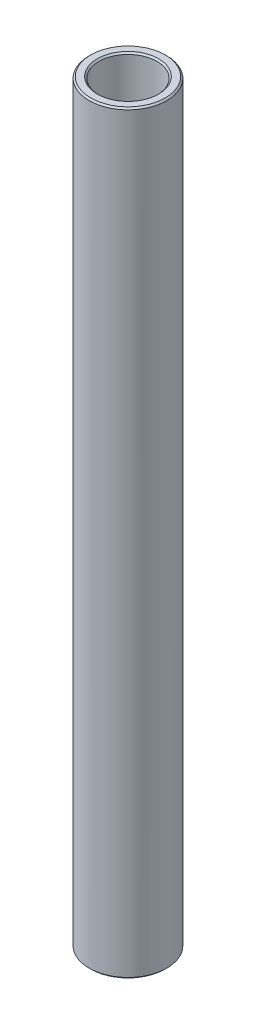
ISO-10303-21;
HEADER;
FILE_DESCRIPTION(('STEP AP214'),'2;1');
FILE_NAME('part.step','',(''),(''),'','','');
FILE_SCHEMA(('AUTOMOTIVE_DESIGN { 1 0 10303 214 1 1 1 1 }'));
ENDSEC;
DATA;
#1=APPLICATION_CONTEXT('core data for automotive mechanical design processes');
#2=APPLICATION_PROTOCOL_DEFINITION('international standard','automotive_design',2000,#1);
#3=PRODUCT_CONTEXT('',#1,'mechanical');
#4=PRODUCT('Part','Part','',(#3));
#5=PRODUCT_RELATED_PRODUCT_CATEGORY('part','',(#4));
#6=PRODUCT_DEFINITION_FORMATION('','',#4);
#7=PRODUCT_DEFINITION_CONTEXT('part definition',#1,'design');
#8=PRODUCT_DEFINITION('design','',#6,#7);
#9=PRODUCT_DEFINITION_SHAPE('','',#8);
#10=(LENGTH_UNIT() NAMED_UNIT(*) SI_UNIT(.MILLI.,.METRE.));
#11=(NAMED_UNIT(*) PLANE_ANGLE_UNIT() SI_UNIT($,.RADIAN.));
#12=(NAMED_UNIT(*) SI_UNIT($,.STERADIAN.) SOLID_ANGLE_UNIT());
#13=UNCERTAINTY_MEASURE_WITH_UNIT(LENGTH_MEASURE(1.E-05),#10,'distance_accuracy_value','');
#14=(GEOMETRIC_REPRESENTATION_CONTEXT(3) GLOBAL_UNCERTAINTY_ASSIGNED_CONTEXT((#13)) GLOBAL_UNIT_ASSIGNED_CONTEXT((#10,
#11,#12)) REPRESENTATION_CONTEXT('',''));
#15=CARTESIAN_POINT('',(0.,0.,0.));
#16=DIRECTION('',(0.,0.,1.));
#17=DIRECTION('',(1.,0.,0.));
#18=AXIS2_PLACEMENT_3D('',#15,#16,#17);
#19=CARTESIAN_POINT('',(0.,11.60859375,0.));
#20=DIRECTION('',(0.,1.,0.));
#21=DIRECTION('',(-1.,0.,0.));
#22=AXIS2_PLACEMENT_3D('',#19,#20,#21);
#23=CYLINDRICAL_SURFACE('',#22,4.7625);
#24=CARTESIAN_POINT('',(0.,-61.462285,0.));
#25=DIRECTION('',(0.,1.,0.));
#26=DIRECTION('',(-1.,0.,0.));
#27=AXIS2_PLACEMENT_3D('',#24,#25,#26);
#28=CIRCLE('',#27,4.7625);
#29=CARTESIAN_POINT('',(-4.76250000000001,-61.462285,0.));
#30=VERTEX_POINT('',#29);
#31=EDGE_CURVE('E52',#30,#30,#28,.F.);
#32=ORIENTED_EDGE('',*,*,#31,.T.);
#33=EDGE_LOOP('',(#32));
#34=FACE_BOUND('',#33,.T.);
#35=CARTESIAN_POINT('',(0.,61.462285,0.));
#36=DIRECTION('',(0.,-1.,0.));
#37=DIRECTION('',(1.,0.,0.));
#38=AXIS2_PLACEMENT_3D('',#35,#36,#37);
#39=CIRCLE('',#38,4.7625);
#40=CARTESIAN_POINT('',(4.76250000000001,61.462285,0.));
#41=VERTEX_POINT('',#40);
#42=EDGE_CURVE('E55',#41,#41,#39,.F.);
#43=ORIENTED_EDGE('',*,*,#42,.T.);
#44=EDGE_LOOP('',(#43));
#45=FACE_BOUND('',#44,.T.);
#46=ADVANCED_FACE('F32',(#34,#45),#23,.F.);
#47=CARTESIAN_POINT('',(4.76249999999999,61.716285,0.));
#48=DIRECTION('',(0.,-1.,0.));
#49=DIRECTION('',(1.,0.,0.));
#50=AXIS2_PLACEMENT_3D('',#47,#48,#49);
#51=PLANE('',#50);
#52=CARTESIAN_POINT('',(0.,61.716285,0.));
#53=DIRECTION('',(0.,-1.,0.));
#54=DIRECTION('',(1.,0.,0.));
#55=AXIS2_PLACEMENT_3D('',#52,#53,#54);
#56=CIRCLE('',#55,6.096);
#57=CARTESIAN_POINT('',(6.09600000000001,61.716285,0.));
#58=VERTEX_POINT('',#57);
#59=EDGE_CURVE('E10',#58,#58,#56,.F.);
#60=ORIENTED_EDGE('',*,*,#59,.T.);
#61=EDGE_LOOP('',(#60));
#62=FACE_BOUND('',#61,.T.);
#63=CARTESIAN_POINT('',(0.,61.716285,0.));
#64=DIRECTION('',(0.,-1.,0.));
#65=DIRECTION('',(1.,0.,0.));
#66=AXIS2_PLACEMENT_3D('',#63,#64,#65);
#67=CIRCLE('',#66,5.01650000000002);
#68=CARTESIAN_POINT('',(5.01650000000003,61.716285,0.));
#69=VERTEX_POINT('',#68);
#70=EDGE_CURVE('E39',#69,#69,#67,.T.);
#71=ORIENTED_EDGE('',*,*,#70,.T.);
#72=EDGE_LOOP('',(#71));
#73=FACE_BOUND('',#72,.T.);
#74=ADVANCED_FACE('F78',(#62,#73),#51,.F.);
#75=CARTESIAN_POINT('',(0.,11.60859375,0.));
#76=DIRECTION('',(0.,1.,0.));
#77=DIRECTION('',(-1.,0.,0.));
#78=AXIS2_PLACEMENT_3D('',#75,#76,#77);
#79=CYLINDRICAL_SURFACE('',#78,6.35);
#80=CARTESIAN_POINT('',(0.,-61.462285,0.));
#81=DIRECTION('',(0.,1.,0.));
#82=DIRECTION('',(-1.,0.,0.));
#83=AXIS2_PLACEMENT_3D('',#80,#81,#82);
#84=CIRCLE('',#83,6.35);
#85=CARTESIAN_POINT('',(-6.35000000000001,-61.462285,0.));
#86=VERTEX_POINT('',#85);
#87=EDGE_CURVE('E43',#86,#86,#84,.T.);
#88=ORIENTED_EDGE('',*,*,#87,.T.);
#89=EDGE_LOOP('',(#88));
#90=FACE_BOUND('',#89,.T.);
#91=CARTESIAN_POINT('',(0.,61.462285,0.));
#92=DIRECTION('',(0.,-1.,0.));
#93=DIRECTION('',(1.,0.,0.));
#94=AXIS2_PLACEMENT_3D('',#91,#92,#93);
#95=CIRCLE('',#94,6.35);
#96=CARTESIAN_POINT('',(6.35000000000001,61.462285,0.));
#97=VERTEX_POINT('',#96);
#98=EDGE_CURVE('E47',#97,#97,#95,.T.);
#99=ORIENTED_EDGE('',*,*,#98,.T.);
#100=EDGE_LOOP('',(#99));
#101=FACE_BOUND('',#100,.T.);
#102=ADVANCED_FACE('F75',(#90,#101),#79,.T.);
#103=CARTESIAN_POINT('',(6.35000000000001,-61.716285,0.));
#104=DIRECTION('',(0.,1.,0.));
#105=DIRECTION('',(-1.,0.,0.));
#106=AXIS2_PLACEMENT_3D('',#103,#104,#105);
#107=PLANE('',#106);
#108=CARTESIAN_POINT('',(0.,-61.716285,0.));
#109=DIRECTION('',(0.,1.,0.));
#110=DIRECTION('',(-1.,0.,0.));
#111=AXIS2_PLACEMENT_3D('',#108,#109,#110);
#112=CIRCLE('',#111,5.01649999999999);
#113=CARTESIAN_POINT('',(-5.0165,-61.716285,0.));
#114=VERTEX_POINT('',#113);
#115=EDGE_CURVE('E58',#114,#114,#112,.T.);
#116=ORIENTED_EDGE('',*,*,#115,.T.);
#117=EDGE_LOOP('',(#116));
#118=FACE_BOUND('',#117,.T.);
#119=CARTESIAN_POINT('',(0.,-61.716285,0.));
#120=DIRECTION('',(0.,1.,0.));
#121=DIRECTION('',(-1.,0.,0.));
#122=AXIS2_PLACEMENT_3D('',#119,#120,#121);
#123=CIRCLE('',#122,6.09599999999998);
#124=CARTESIAN_POINT('',(-6.09599999999998,-61.716285,0.));
#125=VERTEX_POINT('',#124);
#126=EDGE_CURVE('E61',#125,#125,#123,.F.);
#127=ORIENTED_EDGE('',*,*,#126,.T.);
#128=EDGE_LOOP('',(#127));
#129=FACE_BOUND('',#128,.T.);
#130=ADVANCED_FACE('F65',(#118,#129),#107,.F.);
#131=CARTESIAN_POINT('',(0.,-61.716285,0.));
#132=DIRECTION('',(0.,-1.,0.));
#133=DIRECTION('',(1.,0.,0.));
#134=AXIS2_PLACEMENT_3D('',#131,#132,#133);
#135=CONICAL_SURFACE('',#134,5.01649999999999,0.785398163397453);
#136=ORIENTED_EDGE('',*,*,#31,.F.);
#137=EDGE_LOOP('',(#136));
#138=FACE_BOUND('',#137,.T.);
#139=ORIENTED_EDGE('',*,*,#115,.F.);
#140=EDGE_LOOP('',(#139));
#141=FACE_BOUND('',#140,.T.);
#142=ADVANCED_FACE('F71',(#138,#141),#135,.F.);
#143=CARTESIAN_POINT('',(0.,-61.462285,0.));
#144=DIRECTION('',(0.,1.,0.));
#145=DIRECTION('',(-1.,0.,0.));
#146=AXIS2_PLACEMENT_3D('',#143,#144,#145);
#147=CONICAL_SURFACE('',#146,6.35,0.785398163397433);
#148=ORIENTED_EDGE('',*,*,#126,.F.);
#149=EDGE_LOOP('',(#148));
#150=FACE_BOUND('',#149,.T.);
#151=ORIENTED_EDGE('',*,*,#87,.F.);
#152=EDGE_LOOP('',(#151));
#153=FACE_BOUND('',#152,.T.);
#154=ADVANCED_FACE('F67',(#150,#153),#147,.T.);
#155=CARTESIAN_POINT('',(0.,61.716285,0.));
#156=DIRECTION('',(0.,-1.,0.));
#157=DIRECTION('',(1.,0.,0.));
#158=AXIS2_PLACEMENT_3D('',#155,#156,#157);
#159=CONICAL_SURFACE('',#158,6.096,0.785398163397474);
#160=ORIENTED_EDGE('',*,*,#98,.F.);
#161=EDGE_LOOP('',(#160));
#162=FACE_BOUND('',#161,.T.);
#163=ORIENTED_EDGE('',*,*,#59,.F.);
#164=EDGE_LOOP('',(#163));
#165=FACE_BOUND('',#164,.T.);
#166=ADVANCED_FACE('F70',(#162,#165),#159,.T.);
#167=CARTESIAN_POINT('',(0.,61.462285,0.));
#168=DIRECTION('',(0.,1.,0.));
#169=DIRECTION('',(-1.,0.,0.));
#170=AXIS2_PLACEMENT_3D('',#167,#168,#169);
#171=CONICAL_SURFACE('',#170,4.7625,0.785398163397453);
#172=ORIENTED_EDGE('',*,*,#70,.F.);
#173=EDGE_LOOP('',(#172));
#174=FACE_BOUND('',#173,.T.);
#175=ORIENTED_EDGE('',*,*,#42,.F.);
#176=EDGE_LOOP('',(#175));
#177=FACE_BOUND('',#176,.T.);
#178=ADVANCED_FACE('F34',(#174,#177),#171,.F.);
#179=CLOSED_SHELL('',(#46,#74,#102,#130,#142,#154,#166,#178));
#180=MANIFOLD_SOLID_BREP('B2',#179);
#181=ADVANCED_BREP_SHAPE_REPRESENTATION('',(#18,#180),#14);
#182=SHAPE_DEFINITION_REPRESENTATION(#9,#181);
ENDSEC;
END-ISO-10303-21;
